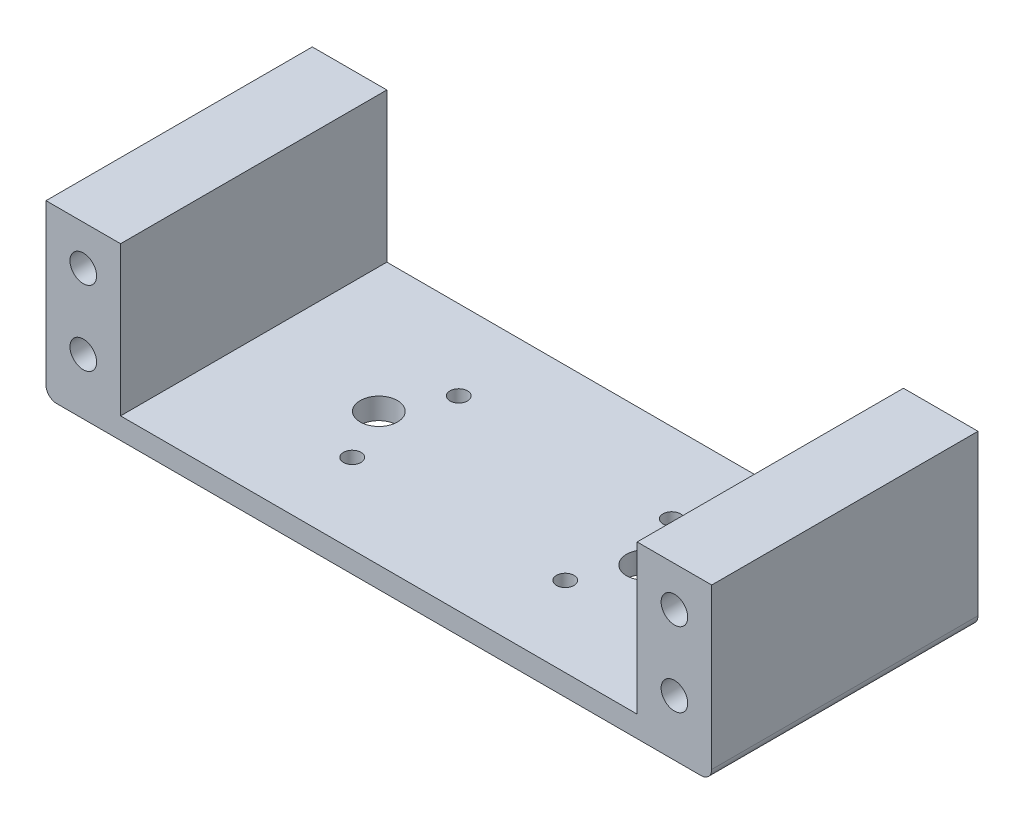
ISO-10303-21;
HEADER;
FILE_DESCRIPTION(('STEP AP214'),'2;1');
FILE_NAME('part.step','',(''),(''),'','','');
FILE_SCHEMA(('AUTOMOTIVE_DESIGN { 1 0 10303 214 1 1 1 1 }'));
ENDSEC;
DATA;
#1=APPLICATION_CONTEXT('core data for automotive mechanical design processes');
#2=APPLICATION_PROTOCOL_DEFINITION('international standard','automotive_design',2000,#1);
#3=PRODUCT_CONTEXT('',#1,'mechanical');
#4=PRODUCT('Part','Part','',(#3));
#5=PRODUCT_RELATED_PRODUCT_CATEGORY('part','',(#4));
#6=PRODUCT_DEFINITION_FORMATION('','',#4);
#7=PRODUCT_DEFINITION_CONTEXT('part definition',#1,'design');
#8=PRODUCT_DEFINITION('design','',#6,#7);
#9=PRODUCT_DEFINITION_SHAPE('','',#8);
#10=(LENGTH_UNIT() NAMED_UNIT(*) SI_UNIT(.MILLI.,.METRE.));
#11=(NAMED_UNIT(*) PLANE_ANGLE_UNIT() SI_UNIT($,.RADIAN.));
#12=(NAMED_UNIT(*) SI_UNIT($,.STERADIAN.) SOLID_ANGLE_UNIT());
#13=UNCERTAINTY_MEASURE_WITH_UNIT(LENGTH_MEASURE(1.E-05),#10,'distance_accuracy_value','');
#14=(GEOMETRIC_REPRESENTATION_CONTEXT(3) GLOBAL_UNCERTAINTY_ASSIGNED_CONTEXT((#13)) GLOBAL_UNIT_ASSIGNED_CONTEXT((#10,
#11,#12)) REPRESENTATION_CONTEXT('',''));
#15=CARTESIAN_POINT('',(0.,0.,0.));
#16=DIRECTION('',(0.,0.,1.));
#17=DIRECTION('',(1.,0.,0.));
#18=AXIS2_PLACEMENT_3D('',#15,#16,#17);
#19=CARTESIAN_POINT('',(0.,4.,0.));
#20=DIRECTION('',(0.,-1.,0.));
#21=DIRECTION('',(0.,0.,-1.));
#22=AXIS2_PLACEMENT_3D('',#19,#20,#21);
#23=PLANE('',#22);
#24=CARTESIAN_POINT('',(37.5,4.,-25.));
#25=DIRECTION('',(0.,-1.,0.));
#26=DIRECTION('',(0.,0.,-1.));
#27=AXIS2_PLACEMENT_3D('',#24,#25,#26);
#28=CIRCLE('',#27,3.5);
#29=CARTESIAN_POINT('',(37.5,4.,-28.5));
#30=VERTEX_POINT('',#29);
#31=EDGE_CURVE('E385',#30,#30,#28,.T.);
#32=ORIENTED_EDGE('',*,*,#31,.T.);
#33=EDGE_LOOP('',(#32));
#34=FACE_BOUND('',#33,.T.);
#35=CARTESIAN_POINT('',(42.5,4.,-35.));
#36=DIRECTION('',(0.,-1.,0.));
#37=DIRECTION('',(0.,0.,-1.));
#38=AXIS2_PLACEMENT_3D('',#35,#36,#37);
#39=CIRCLE('',#38,1.65);
#40=CARTESIAN_POINT('',(42.5,4.,-36.65));
#41=VERTEX_POINT('',#40);
#42=EDGE_CURVE('E400',#41,#41,#39,.T.);
#43=ORIENTED_EDGE('',*,*,#42,.T.);
#44=EDGE_LOOP('',(#43));
#45=FACE_BOUND('',#44,.T.);
#46=CARTESIAN_POINT('',(82.5,4.,-35.));
#47=DIRECTION('',(0.,-1.,0.));
#48=DIRECTION('',(0.,0.,-1.));
#49=AXIS2_PLACEMENT_3D('',#46,#47,#48);
#50=CIRCLE('',#49,1.65);
#51=CARTESIAN_POINT('',(82.5,4.,-36.65));
#52=VERTEX_POINT('',#51);
#53=EDGE_CURVE('E403',#52,#52,#50,.T.);
#54=ORIENTED_EDGE('',*,*,#53,.T.);
#55=EDGE_LOOP('',(#54));
#56=FACE_BOUND('',#55,.T.);
#57=CARTESIAN_POINT('',(42.5,4.,-15.));
#58=DIRECTION('',(0.,-1.,0.));
#59=DIRECTION('',(0.,0.,-1.));
#60=AXIS2_PLACEMENT_3D('',#57,#58,#59);
#61=CIRCLE('',#60,1.65);
#62=CARTESIAN_POINT('',(42.5,4.,-16.65));
#63=VERTEX_POINT('',#62);
#64=EDGE_CURVE('E406',#63,#63,#61,.T.);
#65=ORIENTED_EDGE('',*,*,#64,.T.);
#66=EDGE_LOOP('',(#65));
#67=FACE_BOUND('',#66,.T.);
#68=CARTESIAN_POINT('',(87.5,4.,-25.));
#69=DIRECTION('',(0.,-1.,0.));
#70=DIRECTION('',(0.,0.,-1.));
#71=AXIS2_PLACEMENT_3D('',#68,#69,#70);
#72=CIRCLE('',#71,3.49999999999999);
#73=CARTESIAN_POINT('',(87.5,4.,-28.5));
#74=VERTEX_POINT('',#73);
#75=EDGE_CURVE('E409',#74,#74,#72,.T.);
#76=ORIENTED_EDGE('',*,*,#75,.T.);
#77=EDGE_LOOP('',(#76));
#78=FACE_BOUND('',#77,.T.);
#79=CARTESIAN_POINT('',(82.5,4.,-15.));
#80=DIRECTION('',(0.,-1.,0.));
#81=DIRECTION('',(0.,0.,-1.));
#82=AXIS2_PLACEMENT_3D('',#79,#80,#81);
#83=CIRCLE('',#82,1.65);
#84=CARTESIAN_POINT('',(82.5,4.,-16.65));
#85=VERTEX_POINT('',#84);
#86=EDGE_CURVE('E412',#85,#85,#83,.T.);
#87=ORIENTED_EDGE('',*,*,#86,.T.);
#88=EDGE_LOOP('',(#87));
#89=FACE_BOUND('',#88,.T.);
#90=DIRECTION('',(0.,0.,1.));
#91=VECTOR('',#90,1.);
#92=CARTESIAN_POINT('',(111.,4.,0.));
#93=LINE('',#92,#91);
#94=CARTESIAN_POINT('',(111.,4.,-50.));
#95=VERTEX_POINT('',#94);
#96=CARTESIAN_POINT('',(111.,4.,0.));
#97=VERTEX_POINT('',#96);
#98=EDGE_CURVE('E138',#95,#97,#93,.T.);
#99=ORIENTED_EDGE('',*,*,#98,.F.);
#100=DIRECTION('',(-1.,0.,0.));
#101=VECTOR('',#100,1.);
#102=CARTESIAN_POINT('',(0.,4.,-50.));
#103=LINE('',#102,#101);
#104=CARTESIAN_POINT('',(14.,4.,-50.));
#105=VERTEX_POINT('',#104);
#106=EDGE_CURVE('E175',#95,#105,#103,.T.);
#107=ORIENTED_EDGE('',*,*,#106,.T.);
#108=DIRECTION('',(0.,0.,-1.));
#109=VECTOR('',#108,1.);
#110=CARTESIAN_POINT('',(14.,4.,-50.));
#111=LINE('',#110,#109);
#112=CARTESIAN_POINT('',(14.,4.,0.));
#113=VERTEX_POINT('',#112);
#114=EDGE_CURVE('E153',#113,#105,#111,.T.);
#115=ORIENTED_EDGE('',*,*,#114,.F.);
#116=DIRECTION('',(1.,0.,0.));
#117=VECTOR('',#116,1.);
#118=CARTESIAN_POINT('',(0.,4.,0.));
#119=LINE('',#118,#117);
#120=EDGE_CURVE('E173',#113,#97,#119,.T.);
#121=ORIENTED_EDGE('',*,*,#120,.T.);
#122=EDGE_LOOP('',(#99,#107,#115,#121));
#123=FACE_BOUND('',#122,.T.);
#124=ADVANCED_FACE('F33',(#34,#45,#56,#67,#78,#89,#123),#23,.F.);
#125=CARTESIAN_POINT('',(0.,4.,0.));
#126=DIRECTION('',(1.,0.,0.));
#127=DIRECTION('',(0.,0.,-1.));
#128=AXIS2_PLACEMENT_3D('',#125,#126,#127);
#129=PLANE('',#128);
#130=DIRECTION('',(0.,-1.,0.));
#131=VECTOR('',#130,1.);
#132=CARTESIAN_POINT('',(0.,4.,-50.));
#133=LINE('',#132,#131);
#134=CARTESIAN_POINT('',(0.,32.,-50.));
#135=VERTEX_POINT('',#134);
#136=CARTESIAN_POINT('',(0.,2.,-50.));
#137=VERTEX_POINT('',#136);
#138=EDGE_CURVE('E123',#135,#137,#133,.T.);
#139=ORIENTED_EDGE('',*,*,#138,.T.);
#140=DIRECTION('',(0.,0.,1.));
#141=VECTOR('',#140,1.);
#142=CARTESIAN_POINT('',(0.,2.,0.));
#143=LINE('',#142,#141);
#144=CARTESIAN_POINT('',(0.,2.,0.));
#145=VERTEX_POINT('',#144);
#146=EDGE_CURVE('E11',#137,#145,#143,.T.);
#147=ORIENTED_EDGE('',*,*,#146,.T.);
#148=DIRECTION('',(0.,-1.,0.));
#149=VECTOR('',#148,1.);
#150=CARTESIAN_POINT('',(0.,4.,0.));
#151=LINE('',#150,#149);
#152=CARTESIAN_POINT('',(0.,32.,0.));
#153=VERTEX_POINT('',#152);
#154=EDGE_CURVE('E184',#153,#145,#151,.T.);
#155=ORIENTED_EDGE('',*,*,#154,.F.);
#156=DIRECTION('',(0.,0.,1.));
#157=VECTOR('',#156,1.);
#158=CARTESIAN_POINT('',(0.,32.,-50.));
#159=LINE('',#158,#157);
#160=EDGE_CURVE('E154',#135,#153,#159,.T.);
#161=ORIENTED_EDGE('',*,*,#160,.F.);
#162=EDGE_LOOP('',(#139,#147,#155,#161));
#163=FACE_BOUND('',#162,.T.);
#164=ADVANCED_FACE('F205',(#163),#129,.F.);
#165=CARTESIAN_POINT('',(0.,4.,0.));
#166=DIRECTION('',(0.,0.,-1.));
#167=DIRECTION('',(-1.,0.,0.));
#168=AXIS2_PLACEMENT_3D('',#165,#166,#167);
#169=PLANE('',#168);
#170=CARTESIAN_POINT('',(118.,24.5,0.));
#171=DIRECTION('',(0.,0.,1.));
#172=DIRECTION('',(-1.,0.,0.));
#173=AXIS2_PLACEMENT_3D('',#170,#171,#172);
#174=CIRCLE('',#173,2.49999999999999);
#175=CARTESIAN_POINT('',(115.5,24.5,0.));
#176=VERTEX_POINT('',#175);
#177=EDGE_CURVE('E371',#176,#176,#174,.T.);
#178=ORIENTED_EDGE('',*,*,#177,.F.);
#179=EDGE_LOOP('',(#178));
#180=FACE_BOUND('',#179,.T.);
#181=CARTESIAN_POINT('',(118.,10.5,0.));
#182=DIRECTION('',(0.,0.,1.));
#183=DIRECTION('',(-1.,0.,0.));
#184=AXIS2_PLACEMENT_3D('',#181,#182,#183);
#185=CIRCLE('',#184,2.5);
#186=CARTESIAN_POINT('',(115.5,10.5,0.));
#187=VERTEX_POINT('',#186);
#188=EDGE_CURVE('E365',#187,#187,#185,.T.);
#189=ORIENTED_EDGE('',*,*,#188,.F.);
#190=EDGE_LOOP('',(#189));
#191=FACE_BOUND('',#190,.T.);
#192=CARTESIAN_POINT('',(7.00000000000001,10.5,0.));
#193=DIRECTION('',(0.,0.,1.));
#194=DIRECTION('',(1.,0.,0.));
#195=AXIS2_PLACEMENT_3D('',#192,#193,#194);
#196=CIRCLE('',#195,2.5);
#197=CARTESIAN_POINT('',(9.50000000000001,10.5,0.));
#198=VERTEX_POINT('',#197);
#199=EDGE_CURVE('E353',#198,#198,#196,.T.);
#200=ORIENTED_EDGE('',*,*,#199,.F.);
#201=EDGE_LOOP('',(#200));
#202=FACE_BOUND('',#201,.T.);
#203=CARTESIAN_POINT('',(7.00000000000001,24.5,0.));
#204=DIRECTION('',(0.,0.,1.));
#205=DIRECTION('',(1.,0.,0.));
#206=AXIS2_PLACEMENT_3D('',#203,#204,#205);
#207=CIRCLE('',#206,2.5);
#208=CARTESIAN_POINT('',(9.50000000000001,24.5,0.));
#209=VERTEX_POINT('',#208);
#210=EDGE_CURVE('E144',#209,#209,#207,.T.);
#211=ORIENTED_EDGE('',*,*,#210,.F.);
#212=EDGE_LOOP('',(#211));
#213=FACE_BOUND('',#212,.T.);
#214=DIRECTION('',(1.,0.,0.));
#215=VECTOR('',#214,1.);
#216=CARTESIAN_POINT('',(0.,0.,0.));
#217=LINE('',#216,#215);
#218=CARTESIAN_POINT('',(2.,0.,0.));
#219=VERTEX_POINT('',#218);
#220=CARTESIAN_POINT('',(123.,0.,0.));
#221=VERTEX_POINT('',#220);
#222=EDGE_CURVE('E172',#219,#221,#217,.T.);
#223=ORIENTED_EDGE('',*,*,#222,.T.);
#224=CARTESIAN_POINT('',(123.,2.,0.));
#225=DIRECTION('',(0.,0.,-1.));
#226=DIRECTION('',(-1.,0.,0.));
#227=AXIS2_PLACEMENT_3D('',#224,#225,#226);
#228=CIRCLE('',#227,2.);
#229=CARTESIAN_POINT('',(125.,2.,0.));
#230=VERTEX_POINT('',#229);
#231=EDGE_CURVE('E41',#221,#230,#228,.F.);
#232=ORIENTED_EDGE('',*,*,#231,.T.);
#233=DIRECTION('',(0.,-1.,0.));
#234=VECTOR('',#233,1.);
#235=CARTESIAN_POINT('',(125.,4.,0.));
#236=LINE('',#235,#234);
#237=CARTESIAN_POINT('',(125.,32.,0.));
#238=VERTEX_POINT('',#237);
#239=EDGE_CURVE('E122',#238,#230,#236,.T.);
#240=ORIENTED_EDGE('',*,*,#239,.F.);
#241=DIRECTION('',(1.,0.,0.));
#242=VECTOR('',#241,1.);
#243=CARTESIAN_POINT('',(125.,32.,0.));
#244=LINE('',#243,#242);
#245=CARTESIAN_POINT('',(111.,32.,0.));
#246=VERTEX_POINT('',#245);
#247=EDGE_CURVE('E137',#246,#238,#244,.T.);
#248=ORIENTED_EDGE('',*,*,#247,.F.);
#249=DIRECTION('',(0.,-1.,0.));
#250=VECTOR('',#249,1.);
#251=CARTESIAN_POINT('',(111.,32.,0.));
#252=LINE('',#251,#250);
#253=EDGE_CURVE('E148',#246,#97,#252,.T.);
#254=ORIENTED_EDGE('',*,*,#253,.T.);
#255=ORIENTED_EDGE('',*,*,#120,.F.);
#256=DIRECTION('',(0.,-1.,0.));
#257=VECTOR('',#256,1.);
#258=CARTESIAN_POINT('',(14.,32.,0.));
#259=LINE('',#258,#257);
#260=CARTESIAN_POINT('',(14.,32.,0.));
#261=VERTEX_POINT('',#260);
#262=EDGE_CURVE('E169',#261,#113,#259,.T.);
#263=ORIENTED_EDGE('',*,*,#262,.F.);
#264=DIRECTION('',(1.,0.,0.));
#265=VECTOR('',#264,1.);
#266=CARTESIAN_POINT('',(0.,32.,0.));
#267=LINE('',#266,#265);
#268=EDGE_CURVE('E157',#153,#261,#267,.T.);
#269=ORIENTED_EDGE('',*,*,#268,.F.);
#270=ORIENTED_EDGE('',*,*,#154,.T.);
#271=CARTESIAN_POINT('',(2.,2.,0.));
#272=DIRECTION('',(0.,0.,-1.));
#273=DIRECTION('',(-1.,0.,0.));
#274=AXIS2_PLACEMENT_3D('',#271,#272,#273);
#275=CIRCLE('',#274,2.);
#276=EDGE_CURVE('E48',#145,#219,#275,.F.);
#277=ORIENTED_EDGE('',*,*,#276,.T.);
#278=EDGE_LOOP('',(#223,#232,#240,#248,#254,#255,#263,#269,#270,#277));
#279=FACE_BOUND('',#278,.T.);
#280=ADVANCED_FACE('F197',(#180,#191,#202,#213,#279),#169,.F.);
#281=CARTESIAN_POINT('',(125.,4.,0.));
#282=DIRECTION('',(-1.,0.,0.));
#283=DIRECTION('',(0.,0.,1.));
#284=AXIS2_PLACEMENT_3D('',#281,#282,#283);
#285=PLANE('',#284);
#286=ORIENTED_EDGE('',*,*,#239,.T.);
#287=DIRECTION('',(0.,0.,-1.));
#288=VECTOR('',#287,1.);
#289=CARTESIAN_POINT('',(125.,2.,-50.));
#290=LINE('',#289,#288);
#291=CARTESIAN_POINT('',(125.,2.,-50.));
#292=VERTEX_POINT('',#291);
#293=EDGE_CURVE('E120',#230,#292,#290,.T.);
#294=ORIENTED_EDGE('',*,*,#293,.T.);
#295=DIRECTION('',(0.,-1.,0.));
#296=VECTOR('',#295,1.);
#297=CARTESIAN_POINT('',(125.,4.,-50.));
#298=LINE('',#297,#296);
#299=CARTESIAN_POINT('',(125.,32.,-50.));
#300=VERTEX_POINT('',#299);
#301=EDGE_CURVE('E113',#300,#292,#298,.T.);
#302=ORIENTED_EDGE('',*,*,#301,.F.);
#303=DIRECTION('',(0.,0.,-1.));
#304=VECTOR('',#303,1.);
#305=CARTESIAN_POINT('',(125.,32.,0.));
#306=LINE('',#305,#304);
#307=EDGE_CURVE('E118',#238,#300,#306,.T.);
#308=ORIENTED_EDGE('',*,*,#307,.F.);
#309=EDGE_LOOP('',(#286,#294,#302,#308));
#310=FACE_BOUND('',#309,.T.);
#311=ADVANCED_FACE('F116',(#310),#285,.F.);
#312=CARTESIAN_POINT('',(0.,4.,-50.));
#313=DIRECTION('',(0.,0.,1.));
#314=DIRECTION('',(1.,0.,0.));
#315=AXIS2_PLACEMENT_3D('',#312,#313,#314);
#316=PLANE('',#315);
#317=CARTESIAN_POINT('',(118.,24.5,-50.));
#318=DIRECTION('',(0.,0.,1.));
#319=DIRECTION('',(-1.,0.,0.));
#320=AXIS2_PLACEMENT_3D('',#317,#318,#319);
#321=CIRCLE('',#320,2.49999999999999);
#322=CARTESIAN_POINT('',(115.5,24.5,-50.));
#323=VERTEX_POINT('',#322);
#324=EDGE_CURVE('E381',#323,#323,#321,.T.);
#325=ORIENTED_EDGE('',*,*,#324,.T.);
#326=EDGE_LOOP('',(#325));
#327=FACE_BOUND('',#326,.T.);
#328=CARTESIAN_POINT('',(118.,10.5,-50.));
#329=DIRECTION('',(0.,0.,1.));
#330=DIRECTION('',(-1.,0.,0.));
#331=AXIS2_PLACEMENT_3D('',#328,#329,#330);
#332=CIRCLE('',#331,2.5);
#333=CARTESIAN_POINT('',(115.5,10.5,-50.));
#334=VERTEX_POINT('',#333);
#335=EDGE_CURVE('E388',#334,#334,#332,.T.);
#336=ORIENTED_EDGE('',*,*,#335,.T.);
#337=EDGE_LOOP('',(#336));
#338=FACE_BOUND('',#337,.T.);
#339=CARTESIAN_POINT('',(7.00000000000001,10.5,-50.));
#340=DIRECTION('',(0.,0.,1.));
#341=DIRECTION('',(1.,0.,0.));
#342=AXIS2_PLACEMENT_3D('',#339,#340,#341);
#343=CIRCLE('',#342,2.5);
#344=CARTESIAN_POINT('',(9.50000000000001,10.5,-50.));
#345=VERTEX_POINT('',#344);
#346=EDGE_CURVE('E394',#345,#345,#343,.T.);
#347=ORIENTED_EDGE('',*,*,#346,.T.);
#348=EDGE_LOOP('',(#347));
#349=FACE_BOUND('',#348,.T.);
#350=CARTESIAN_POINT('',(7.00000000000001,24.5,-50.));
#351=DIRECTION('',(0.,0.,1.));
#352=DIRECTION('',(1.,0.,0.));
#353=AXIS2_PLACEMENT_3D('',#350,#351,#352);
#354=CIRCLE('',#353,2.5);
#355=CARTESIAN_POINT('',(9.50000000000001,24.5,-50.));
#356=VERTEX_POINT('',#355);
#357=EDGE_CURVE('E360',#356,#356,#354,.T.);
#358=ORIENTED_EDGE('',*,*,#357,.T.);
#359=EDGE_LOOP('',(#358));
#360=FACE_BOUND('',#359,.T.);
#361=ORIENTED_EDGE('',*,*,#301,.T.);
#362=CARTESIAN_POINT('',(123.,2.,-50.));
#363=DIRECTION('',(0.,0.,1.));
#364=DIRECTION('',(1.,0.,0.));
#365=AXIS2_PLACEMENT_3D('',#362,#363,#364);
#366=CIRCLE('',#365,2.);
#367=CARTESIAN_POINT('',(123.,0.,-50.));
#368=VERTEX_POINT('',#367);
#369=EDGE_CURVE('E190',#292,#368,#366,.F.);
#370=ORIENTED_EDGE('',*,*,#369,.T.);
#371=DIRECTION('',(-1.,0.,0.));
#372=VECTOR('',#371,1.);
#373=CARTESIAN_POINT('',(0.,0.,-50.));
#374=LINE('',#373,#372);
#375=CARTESIAN_POINT('',(2.,0.,-50.));
#376=VERTEX_POINT('',#375);
#377=EDGE_CURVE('E176',#368,#376,#374,.T.);
#378=ORIENTED_EDGE('',*,*,#377,.T.);
#379=CARTESIAN_POINT('',(2.,2.,-50.));
#380=DIRECTION('',(0.,0.,1.));
#381=DIRECTION('',(1.,0.,0.));
#382=AXIS2_PLACEMENT_3D('',#379,#380,#381);
#383=CIRCLE('',#382,2.);
#384=EDGE_CURVE('E188',#376,#137,#383,.F.);
#385=ORIENTED_EDGE('',*,*,#384,.T.);
#386=ORIENTED_EDGE('',*,*,#138,.F.);
#387=DIRECTION('',(-1.,0.,0.));
#388=VECTOR('',#387,1.);
#389=CARTESIAN_POINT('',(0.,32.,-50.));
#390=LINE('',#389,#388);
#391=CARTESIAN_POINT('',(14.,32.,-50.));
#392=VERTEX_POINT('',#391);
#393=EDGE_CURVE('E161',#392,#135,#390,.T.);
#394=ORIENTED_EDGE('',*,*,#393,.F.);
#395=DIRECTION('',(0.,-1.,0.));
#396=VECTOR('',#395,1.);
#397=CARTESIAN_POINT('',(14.,32.,-50.));
#398=LINE('',#397,#396);
#399=EDGE_CURVE('E164',#392,#105,#398,.T.);
#400=ORIENTED_EDGE('',*,*,#399,.T.);
#401=ORIENTED_EDGE('',*,*,#106,.F.);
#402=DIRECTION('',(0.,-1.,0.));
#403=VECTOR('',#402,1.);
#404=CARTESIAN_POINT('',(111.,32.,-50.));
#405=LINE('',#404,#403);
#406=CARTESIAN_POINT('',(111.,32.,-50.));
#407=VERTEX_POINT('',#406);
#408=EDGE_CURVE('E129',#407,#95,#405,.T.);
#409=ORIENTED_EDGE('',*,*,#408,.F.);
#410=DIRECTION('',(-1.,0.,0.));
#411=VECTOR('',#410,1.);
#412=CARTESIAN_POINT('',(125.,32.,-50.));
#413=LINE('',#412,#411);
#414=EDGE_CURVE('E126',#300,#407,#413,.T.);
#415=ORIENTED_EDGE('',*,*,#414,.F.);
#416=EDGE_LOOP('',(#361,#370,#378,#385,#386,#394,#400,#401,#409,#415));
#417=FACE_BOUND('',#416,.T.);
#418=ADVANCED_FACE('F127',(#327,#338,#349,#360,#417),#316,.F.);
#419=CARTESIAN_POINT('',(0.,0.,0.));
#420=DIRECTION('',(0.,-1.,0.));
#421=DIRECTION('',(0.,0.,-1.));
#422=AXIS2_PLACEMENT_3D('',#419,#420,#421);
#423=PLANE('',#422);
#424=CARTESIAN_POINT('',(37.5,0.,-25.));
#425=DIRECTION('',(0.,-1.,0.));
#426=DIRECTION('',(0.,0.,-1.));
#427=AXIS2_PLACEMENT_3D('',#424,#425,#426);
#428=CIRCLE('',#427,3.5);
#429=CARTESIAN_POINT('',(37.5,0.,-28.5));
#430=VERTEX_POINT('',#429);
#431=EDGE_CURVE('E425',#430,#430,#428,.T.);
#432=ORIENTED_EDGE('',*,*,#431,.F.);
#433=EDGE_LOOP('',(#432));
#434=FACE_BOUND('',#433,.T.);
#435=CARTESIAN_POINT('',(42.5,0.,-35.));
#436=DIRECTION('',(0.,-1.,0.));
#437=DIRECTION('',(0.,0.,-1.));
#438=AXIS2_PLACEMENT_3D('',#435,#436,#437);
#439=CIRCLE('',#438,1.65);
#440=CARTESIAN_POINT('',(42.5,0.,-36.65));
#441=VERTEX_POINT('',#440);
#442=EDGE_CURVE('E422',#441,#441,#439,.T.);
#443=ORIENTED_EDGE('',*,*,#442,.F.);
#444=EDGE_LOOP('',(#443));
#445=FACE_BOUND('',#444,.T.);
#446=CARTESIAN_POINT('',(82.5,0.,-35.));
#447=DIRECTION('',(0.,-1.,0.));
#448=DIRECTION('',(0.,0.,1.));
#449=AXIS2_PLACEMENT_3D('',#446,#447,#448);
#450=CIRCLE('',#449,1.65);
#451=CARTESIAN_POINT('',(82.5,0.,-33.35));
#452=VERTEX_POINT('',#451);
#453=EDGE_CURVE('E419',#452,#452,#450,.T.);
#454=ORIENTED_EDGE('',*,*,#453,.F.);
#455=EDGE_LOOP('',(#454));
#456=FACE_BOUND('',#455,.T.);
#457=CARTESIAN_POINT('',(42.5,0.,-15.));
#458=DIRECTION('',(0.,-1.,0.));
#459=DIRECTION('',(0.,0.,1.));
#460=AXIS2_PLACEMENT_3D('',#457,#458,#459);
#461=CIRCLE('',#460,1.65);
#462=CARTESIAN_POINT('',(42.5,0.,-13.35));
#463=VERTEX_POINT('',#462);
#464=EDGE_CURVE('E418',#463,#463,#461,.T.);
#465=ORIENTED_EDGE('',*,*,#464,.F.);
#466=EDGE_LOOP('',(#465));
#467=FACE_BOUND('',#466,.T.);
#468=CARTESIAN_POINT('',(87.5,0.,-25.));
#469=DIRECTION('',(0.,-1.,0.));
#470=DIRECTION('',(0.,0.,1.));
#471=AXIS2_PLACEMENT_3D('',#468,#469,#470);
#472=CIRCLE('',#471,3.49999999999999);
#473=CARTESIAN_POINT('',(87.5,0.,-21.5));
#474=VERTEX_POINT('',#473);
#475=EDGE_CURVE('E427',#474,#474,#472,.T.);
#476=ORIENTED_EDGE('',*,*,#475,.F.);
#477=EDGE_LOOP('',(#476));
#478=FACE_BOUND('',#477,.T.);
#479=CARTESIAN_POINT('',(82.5,0.,-15.));
#480=DIRECTION('',(0.,-1.,0.));
#481=DIRECTION('',(0.,0.,-1.));
#482=AXIS2_PLACEMENT_3D('',#479,#480,#481);
#483=CIRCLE('',#482,1.65);
#484=CARTESIAN_POINT('',(82.5,0.,-16.65));
#485=VERTEX_POINT('',#484);
#486=EDGE_CURVE('E415',#485,#485,#483,.T.);
#487=ORIENTED_EDGE('',*,*,#486,.F.);
#488=EDGE_LOOP('',(#487));
#489=FACE_BOUND('',#488,.T.);
#490=ORIENTED_EDGE('',*,*,#377,.F.);
#491=DIRECTION('',(0.,0.,-1.));
#492=VECTOR('',#491,1.);
#493=CARTESIAN_POINT('',(123.,0.,0.));
#494=LINE('',#493,#492);
#495=EDGE_CURVE('E55',#368,#221,#494,.F.);
#496=ORIENTED_EDGE('',*,*,#495,.T.);
#497=ORIENTED_EDGE('',*,*,#222,.F.);
#498=DIRECTION('',(0.,0.,1.));
#499=VECTOR('',#498,1.);
#500=CARTESIAN_POINT('',(2.,0.,-50.));
#501=LINE('',#500,#499);
#502=EDGE_CURVE('E192',#219,#376,#501,.F.);
#503=ORIENTED_EDGE('',*,*,#502,.T.);
#504=EDGE_LOOP('',(#490,#496,#497,#503));
#505=FACE_BOUND('',#504,.T.);
#506=ADVANCED_FACE('F201',(#434,#445,#456,#467,#478,#489,#505),#423,.T.);
#507=CARTESIAN_POINT('',(14.,32.,-50.));
#508=DIRECTION('',(-1.,0.,0.));
#509=DIRECTION('',(0.,0.,1.));
#510=AXIS2_PLACEMENT_3D('',#507,#508,#509);
#511=PLANE('',#510);
#512=ORIENTED_EDGE('',*,*,#114,.T.);
#513=ORIENTED_EDGE('',*,*,#399,.F.);
#514=DIRECTION('',(0.,0.,-1.));
#515=VECTOR('',#514,1.);
#516=CARTESIAN_POINT('',(14.,32.,-50.));
#517=LINE('',#516,#515);
#518=EDGE_CURVE('E159',#261,#392,#517,.T.);
#519=ORIENTED_EDGE('',*,*,#518,.F.);
#520=ORIENTED_EDGE('',*,*,#262,.T.);
#521=EDGE_LOOP('',(#512,#513,#519,#520));
#522=FACE_BOUND('',#521,.T.);
#523=ADVANCED_FACE('F214',(#522),#511,.F.);
#524=CARTESIAN_POINT('',(0.,32.,0.));
#525=DIRECTION('',(0.,1.,0.));
#526=DIRECTION('',(0.,0.,1.));
#527=AXIS2_PLACEMENT_3D('',#524,#525,#526);
#528=PLANE('',#527);
#529=ORIENTED_EDGE('',*,*,#160,.T.);
#530=ORIENTED_EDGE('',*,*,#268,.T.);
#531=ORIENTED_EDGE('',*,*,#518,.T.);
#532=ORIENTED_EDGE('',*,*,#393,.T.);
#533=EDGE_LOOP('',(#529,#530,#531,#532));
#534=FACE_BOUND('',#533,.T.);
#535=ADVANCED_FACE('F208',(#534),#528,.T.);
#536=CARTESIAN_POINT('',(111.,32.,0.));
#537=DIRECTION('',(1.,0.,0.));
#538=DIRECTION('',(0.,0.,-1.));
#539=AXIS2_PLACEMENT_3D('',#536,#537,#538);
#540=PLANE('',#539);
#541=ORIENTED_EDGE('',*,*,#98,.T.);
#542=ORIENTED_EDGE('',*,*,#253,.F.);
#543=DIRECTION('',(0.,0.,1.));
#544=VECTOR('',#543,1.);
#545=CARTESIAN_POINT('',(111.,32.,0.));
#546=LINE('',#545,#544);
#547=EDGE_CURVE('E132',#407,#246,#546,.T.);
#548=ORIENTED_EDGE('',*,*,#547,.F.);
#549=ORIENTED_EDGE('',*,*,#408,.T.);
#550=EDGE_LOOP('',(#541,#542,#548,#549));
#551=FACE_BOUND('',#550,.T.);
#552=ADVANCED_FACE('F219',(#551),#540,.F.);
#553=CARTESIAN_POINT('',(0.,32.,0.));
#554=DIRECTION('',(0.,1.,0.));
#555=DIRECTION('',(0.,0.,1.));
#556=AXIS2_PLACEMENT_3D('',#553,#554,#555);
#557=PLANE('',#556);
#558=ORIENTED_EDGE('',*,*,#307,.T.);
#559=ORIENTED_EDGE('',*,*,#414,.T.);
#560=ORIENTED_EDGE('',*,*,#547,.T.);
#561=ORIENTED_EDGE('',*,*,#247,.T.);
#562=EDGE_LOOP('',(#558,#559,#560,#561));
#563=FACE_BOUND('',#562,.T.);
#564=ADVANCED_FACE('F135',(#563),#557,.T.);
#565=CARTESIAN_POINT('',(7.00000000000001,24.5,-4.78));
#566=DIRECTION('',(0.,0.,1.));
#567=DIRECTION('',(1.,0.,0.));
#568=AXIS2_PLACEMENT_3D('',#565,#566,#567);
#569=CYLINDRICAL_SURFACE('',#568,2.5);
#570=CARTESIAN_POINT('',(7.00000000000001,24.5,-4.78));
#571=DIRECTION('',(0.,0.,1.));
#572=DIRECTION('',(1.,0.,0.));
#573=AXIS2_PLACEMENT_3D('',#570,#571,#572);
#574=CIRCLE('',#573,2.5);
#575=CARTESIAN_POINT('',(9.50000000000001,24.5,-4.78));
#576=VERTEX_POINT('',#575);
#577=EDGE_CURVE('E141',#576,#576,#574,.T.);
#578=ORIENTED_EDGE('',*,*,#577,.F.);
#579=EDGE_LOOP('',(#578));
#580=FACE_BOUND('',#579,.T.);
#581=ORIENTED_EDGE('',*,*,#210,.T.);
#582=EDGE_LOOP('',(#581));
#583=FACE_BOUND('',#582,.T.);
#584=ADVANCED_FACE('F226',(#580,#583),#569,.F.);
#585=CARTESIAN_POINT('',(7.00000000000001,24.5,-4.78));
#586=DIRECTION('',(0.,0.,1.));
#587=DIRECTION('',(1.,0.,0.));
#588=AXIS2_PLACEMENT_3D('',#585,#586,#587);
#589=PLANE('',#588);
#590=ORIENTED_EDGE('',*,*,#577,.T.);
#591=EDGE_LOOP('',(#590));
#592=FACE_BOUND('',#591,.T.);
#593=ADVANCED_FACE('F322',(#592),#589,.T.);
#594=CARTESIAN_POINT('',(7.00000000000001,10.5,-4.78));
#595=DIRECTION('',(0.,0.,1.));
#596=DIRECTION('',(1.,0.,0.));
#597=AXIS2_PLACEMENT_3D('',#594,#595,#596);
#598=CYLINDRICAL_SURFACE('',#597,2.5);
#599=CARTESIAN_POINT('',(7.00000000000001,10.5,-4.78));
#600=DIRECTION('',(0.,0.,1.));
#601=DIRECTION('',(1.,0.,0.));
#602=AXIS2_PLACEMENT_3D('',#599,#600,#601);
#603=CIRCLE('',#602,2.5);
#604=CARTESIAN_POINT('',(9.50000000000001,10.5,-4.78));
#605=VERTEX_POINT('',#604);
#606=EDGE_CURVE('E351',#605,#605,#603,.T.);
#607=ORIENTED_EDGE('',*,*,#606,.F.);
#608=EDGE_LOOP('',(#607));
#609=FACE_BOUND('',#608,.T.);
#610=ORIENTED_EDGE('',*,*,#199,.T.);
#611=EDGE_LOOP('',(#610));
#612=FACE_BOUND('',#611,.T.);
#613=ADVANCED_FACE('F318',(#609,#612),#598,.F.);
#614=CARTESIAN_POINT('',(7.00000000000001,10.5,-4.78));
#615=DIRECTION('',(0.,0.,1.));
#616=DIRECTION('',(1.,0.,0.));
#617=AXIS2_PLACEMENT_3D('',#614,#615,#616);
#618=PLANE('',#617);
#619=ORIENTED_EDGE('',*,*,#606,.T.);
#620=EDGE_LOOP('',(#619));
#621=FACE_BOUND('',#620,.T.);
#622=ADVANCED_FACE('F314',(#621),#618,.T.);
#623=CARTESIAN_POINT('',(118.,10.5,-4.78));
#624=DIRECTION('',(0.,0.,1.));
#625=DIRECTION('',(1.,0.,0.));
#626=AXIS2_PLACEMENT_3D('',#623,#624,#625);
#627=CYLINDRICAL_SURFACE('',#626,2.5);
#628=CARTESIAN_POINT('',(118.,10.5,-4.78));
#629=DIRECTION('',(0.,0.,1.));
#630=DIRECTION('',(-1.,0.,0.));
#631=AXIS2_PLACEMENT_3D('',#628,#629,#630);
#632=CIRCLE('',#631,2.5);
#633=CARTESIAN_POINT('',(115.5,10.5,-4.78));
#634=VERTEX_POINT('',#633);
#635=EDGE_CURVE('E357',#634,#634,#632,.T.);
#636=ORIENTED_EDGE('',*,*,#635,.F.);
#637=EDGE_LOOP('',(#636));
#638=FACE_BOUND('',#637,.T.);
#639=ORIENTED_EDGE('',*,*,#188,.T.);
#640=EDGE_LOOP('',(#639));
#641=FACE_BOUND('',#640,.T.);
#642=ADVANCED_FACE('F317',(#638,#641),#627,.F.);
#643=CARTESIAN_POINT('',(118.,10.5,-4.78));
#644=DIRECTION('',(0.,0.,-1.));
#645=DIRECTION('',(-1.,0.,0.));
#646=AXIS2_PLACEMENT_3D('',#643,#644,#645);
#647=PLANE('',#646);
#648=ORIENTED_EDGE('',*,*,#635,.T.);
#649=EDGE_LOOP('',(#648));
#650=FACE_BOUND('',#649,.T.);
#651=ADVANCED_FACE('F324',(#650),#647,.F.);
#652=CARTESIAN_POINT('',(118.,24.5,-4.78));
#653=DIRECTION('',(0.,0.,1.));
#654=DIRECTION('',(1.,0.,0.));
#655=AXIS2_PLACEMENT_3D('',#652,#653,#654);
#656=CYLINDRICAL_SURFACE('',#655,2.49999999999999);
#657=CARTESIAN_POINT('',(118.,24.5,-4.78));
#658=DIRECTION('',(0.,0.,1.));
#659=DIRECTION('',(-1.,0.,0.));
#660=AXIS2_PLACEMENT_3D('',#657,#658,#659);
#661=CIRCLE('',#660,2.49999999999999);
#662=CARTESIAN_POINT('',(115.5,24.5,-4.78));
#663=VERTEX_POINT('',#662);
#664=EDGE_CURVE('E368',#663,#663,#661,.T.);
#665=ORIENTED_EDGE('',*,*,#664,.F.);
#666=EDGE_LOOP('',(#665));
#667=FACE_BOUND('',#666,.T.);
#668=ORIENTED_EDGE('',*,*,#177,.T.);
#669=EDGE_LOOP('',(#668));
#670=FACE_BOUND('',#669,.T.);
#671=ADVANCED_FACE('F327',(#667,#670),#656,.F.);
#672=CARTESIAN_POINT('',(118.,24.5,-4.78));
#673=DIRECTION('',(0.,0.,-1.));
#674=DIRECTION('',(-1.,0.,0.));
#675=AXIS2_PLACEMENT_3D('',#672,#673,#674);
#676=PLANE('',#675);
#677=ORIENTED_EDGE('',*,*,#664,.T.);
#678=EDGE_LOOP('',(#677));
#679=FACE_BOUND('',#678,.T.);
#680=ADVANCED_FACE('F312',(#679),#676,.F.);
#681=CARTESIAN_POINT('',(7.00000000000001,24.5,-45.22));
#682=DIRECTION('',(0.,0.,-1.));
#683=DIRECTION('',(-1.,0.,0.));
#684=AXIS2_PLACEMENT_3D('',#681,#682,#683);
#685=CYLINDRICAL_SURFACE('',#684,2.5);
#686=CARTESIAN_POINT('',(7.00000000000001,24.5,-45.22));
#687=DIRECTION('',(0.,0.,1.));
#688=DIRECTION('',(1.,0.,0.));
#689=AXIS2_PLACEMENT_3D('',#686,#687,#688);
#690=CIRCLE('',#689,2.5);
#691=CARTESIAN_POINT('',(9.50000000000001,24.5,-45.22));
#692=VERTEX_POINT('',#691);
#693=EDGE_CURVE('E373',#692,#692,#690,.T.);
#694=ORIENTED_EDGE('',*,*,#693,.T.);
#695=EDGE_LOOP('',(#694));
#696=FACE_BOUND('',#695,.T.);
#697=ORIENTED_EDGE('',*,*,#357,.F.);
#698=EDGE_LOOP('',(#697));
#699=FACE_BOUND('',#698,.T.);
#700=ADVANCED_FACE('F308',(#696,#699),#685,.F.);
#701=CARTESIAN_POINT('',(7.00000000000001,24.5,-45.22));
#702=DIRECTION('',(0.,0.,-1.));
#703=DIRECTION('',(1.,0.,0.));
#704=AXIS2_PLACEMENT_3D('',#701,#702,#703);
#705=PLANE('',#704);
#706=ORIENTED_EDGE('',*,*,#693,.F.);
#707=EDGE_LOOP('',(#706));
#708=FACE_BOUND('',#707,.T.);
#709=ADVANCED_FACE('F290',(#708),#705,.T.);
#710=CARTESIAN_POINT('',(7.00000000000001,10.5,-45.22));
#711=DIRECTION('',(0.,0.,-1.));
#712=DIRECTION('',(-1.,0.,0.));
#713=AXIS2_PLACEMENT_3D('',#710,#711,#712);
#714=CYLINDRICAL_SURFACE('',#713,2.5);
#715=CARTESIAN_POINT('',(7.00000000000001,10.5,-45.22));
#716=DIRECTION('',(0.,0.,1.));
#717=DIRECTION('',(1.,0.,0.));
#718=AXIS2_PLACEMENT_3D('',#715,#716,#717);
#719=CIRCLE('',#718,2.5);
#720=CARTESIAN_POINT('',(9.50000000000001,10.5,-45.22));
#721=VERTEX_POINT('',#720);
#722=EDGE_CURVE('E379',#721,#721,#719,.T.);
#723=ORIENTED_EDGE('',*,*,#722,.T.);
#724=EDGE_LOOP('',(#723));
#725=FACE_BOUND('',#724,.T.);
#726=ORIENTED_EDGE('',*,*,#346,.F.);
#727=EDGE_LOOP('',(#726));
#728=FACE_BOUND('',#727,.T.);
#729=ADVANCED_FACE('F286',(#725,#728),#714,.F.);
#730=CARTESIAN_POINT('',(7.00000000000001,10.5,-45.22));
#731=DIRECTION('',(0.,0.,-1.));
#732=DIRECTION('',(1.,0.,0.));
#733=AXIS2_PLACEMENT_3D('',#730,#731,#732);
#734=PLANE('',#733);
#735=ORIENTED_EDGE('',*,*,#722,.F.);
#736=EDGE_LOOP('',(#735));
#737=FACE_BOUND('',#736,.T.);
#738=ADVANCED_FACE('F282',(#737),#734,.T.);
#739=CARTESIAN_POINT('',(118.,10.5,-45.22));
#740=DIRECTION('',(0.,0.,-1.));
#741=DIRECTION('',(-1.,0.,0.));
#742=AXIS2_PLACEMENT_3D('',#739,#740,#741);
#743=CYLINDRICAL_SURFACE('',#742,2.5);
#744=CARTESIAN_POINT('',(118.,10.5,-45.22));
#745=DIRECTION('',(0.,0.,1.));
#746=DIRECTION('',(-1.,0.,0.));
#747=AXIS2_PLACEMENT_3D('',#744,#745,#746);
#748=CIRCLE('',#747,2.5);
#749=CARTESIAN_POINT('',(115.5,10.5,-45.22));
#750=VERTEX_POINT('',#749);
#751=EDGE_CURVE('E391',#750,#750,#748,.T.);
#752=ORIENTED_EDGE('',*,*,#751,.T.);
#753=EDGE_LOOP('',(#752));
#754=FACE_BOUND('',#753,.T.);
#755=ORIENTED_EDGE('',*,*,#335,.F.);
#756=EDGE_LOOP('',(#755));
#757=FACE_BOUND('',#756,.T.);
#758=ADVANCED_FACE('F285',(#754,#757),#743,.F.);
#759=CARTESIAN_POINT('',(118.,10.5,-45.22));
#760=DIRECTION('',(0.,0.,1.));
#761=DIRECTION('',(-1.,0.,0.));
#762=AXIS2_PLACEMENT_3D('',#759,#760,#761);
#763=PLANE('',#762);
#764=ORIENTED_EDGE('',*,*,#751,.F.);
#765=EDGE_LOOP('',(#764));
#766=FACE_BOUND('',#765,.T.);
#767=ADVANCED_FACE('F292',(#766),#763,.F.);
#768=CARTESIAN_POINT('',(118.,24.5,-45.22));
#769=DIRECTION('',(0.,0.,-1.));
#770=DIRECTION('',(-1.,0.,0.));
#771=AXIS2_PLACEMENT_3D('',#768,#769,#770);
#772=CYLINDRICAL_SURFACE('',#771,2.49999999999999);
#773=CARTESIAN_POINT('',(118.,24.5,-45.22));
#774=DIRECTION('',(0.,0.,1.));
#775=DIRECTION('',(-1.,0.,0.));
#776=AXIS2_PLACEMENT_3D('',#773,#774,#775);
#777=CIRCLE('',#776,2.49999999999999);
#778=CARTESIAN_POINT('',(115.5,24.5,-45.22));
#779=VERTEX_POINT('',#778);
#780=EDGE_CURVE('E384',#779,#779,#777,.T.);
#781=ORIENTED_EDGE('',*,*,#780,.T.);
#782=EDGE_LOOP('',(#781));
#783=FACE_BOUND('',#782,.T.);
#784=ORIENTED_EDGE('',*,*,#324,.F.);
#785=EDGE_LOOP('',(#784));
#786=FACE_BOUND('',#785,.T.);
#787=ADVANCED_FACE('F295',(#783,#786),#772,.F.);
#788=CARTESIAN_POINT('',(118.,24.5,-45.22));
#789=DIRECTION('',(0.,0.,1.));
#790=DIRECTION('',(-1.,0.,0.));
#791=AXIS2_PLACEMENT_3D('',#788,#789,#790);
#792=PLANE('',#791);
#793=ORIENTED_EDGE('',*,*,#780,.F.);
#794=EDGE_LOOP('',(#793));
#795=FACE_BOUND('',#794,.T.);
#796=ADVANCED_FACE('F280',(#795),#792,.F.);
#797=CARTESIAN_POINT('',(82.5,32.,-15.));
#798=DIRECTION('',(0.,-1.,0.));
#799=DIRECTION('',(0.,0.,-1.));
#800=AXIS2_PLACEMENT_3D('',#797,#798,#799);
#801=CYLINDRICAL_SURFACE('',#800,1.65);
#802=ORIENTED_EDGE('',*,*,#486,.T.);
#803=EDGE_LOOP('',(#802));
#804=FACE_BOUND('',#803,.T.);
#805=ORIENTED_EDGE('',*,*,#86,.F.);
#806=EDGE_LOOP('',(#805));
#807=FACE_BOUND('',#806,.T.);
#808=ADVANCED_FACE('F277',(#804,#807),#801,.F.);
#809=CARTESIAN_POINT('',(87.5,32.,-25.));
#810=DIRECTION('',(0.,-1.,0.));
#811=DIRECTION('',(0.,0.,-1.));
#812=AXIS2_PLACEMENT_3D('',#809,#810,#811);
#813=CYLINDRICAL_SURFACE('',#812,3.49999999999999);
#814=ORIENTED_EDGE('',*,*,#475,.T.);
#815=EDGE_LOOP('',(#814));
#816=FACE_BOUND('',#815,.T.);
#817=ORIENTED_EDGE('',*,*,#75,.F.);
#818=EDGE_LOOP('',(#817));
#819=FACE_BOUND('',#818,.T.);
#820=ADVANCED_FACE('F272',(#816,#819),#813,.F.);
#821=CARTESIAN_POINT('',(42.5,32.,-15.));
#822=DIRECTION('',(0.,-1.,0.));
#823=DIRECTION('',(0.,0.,-1.));
#824=AXIS2_PLACEMENT_3D('',#821,#822,#823);
#825=CYLINDRICAL_SURFACE('',#824,1.65);
#826=ORIENTED_EDGE('',*,*,#464,.T.);
#827=EDGE_LOOP('',(#826));
#828=FACE_BOUND('',#827,.T.);
#829=ORIENTED_EDGE('',*,*,#64,.F.);
#830=EDGE_LOOP('',(#829));
#831=FACE_BOUND('',#830,.T.);
#832=ADVANCED_FACE('F269',(#828,#831),#825,.F.);
#833=CARTESIAN_POINT('',(82.5,32.,-35.));
#834=DIRECTION('',(0.,-1.,0.));
#835=DIRECTION('',(0.,0.,-1.));
#836=AXIS2_PLACEMENT_3D('',#833,#834,#835);
#837=CYLINDRICAL_SURFACE('',#836,1.65);
#838=ORIENTED_EDGE('',*,*,#453,.T.);
#839=EDGE_LOOP('',(#838));
#840=FACE_BOUND('',#839,.T.);
#841=ORIENTED_EDGE('',*,*,#53,.F.);
#842=EDGE_LOOP('',(#841));
#843=FACE_BOUND('',#842,.T.);
#844=ADVANCED_FACE('F262',(#840,#843),#837,.F.);
#845=CARTESIAN_POINT('',(42.5,32.,-35.));
#846=DIRECTION('',(0.,-1.,0.));
#847=DIRECTION('',(0.,0.,-1.));
#848=AXIS2_PLACEMENT_3D('',#845,#846,#847);
#849=CYLINDRICAL_SURFACE('',#848,1.65);
#850=ORIENTED_EDGE('',*,*,#442,.T.);
#851=EDGE_LOOP('',(#850));
#852=FACE_BOUND('',#851,.T.);
#853=ORIENTED_EDGE('',*,*,#42,.F.);
#854=EDGE_LOOP('',(#853));
#855=FACE_BOUND('',#854,.T.);
#856=ADVANCED_FACE('F256',(#852,#855),#849,.F.);
#857=CARTESIAN_POINT('',(37.5,32.,-25.));
#858=DIRECTION('',(0.,-1.,0.));
#859=DIRECTION('',(0.,0.,-1.));
#860=AXIS2_PLACEMENT_3D('',#857,#858,#859);
#861=CYLINDRICAL_SURFACE('',#860,3.5);
#862=ORIENTED_EDGE('',*,*,#431,.T.);
#863=EDGE_LOOP('',(#862));
#864=FACE_BOUND('',#863,.T.);
#865=ORIENTED_EDGE('',*,*,#31,.F.);
#866=EDGE_LOOP('',(#865));
#867=FACE_BOUND('',#866,.T.);
#868=ADVANCED_FACE('F251',(#864,#867),#861,.F.);
#869=CARTESIAN_POINT('',(123.,2.,0.));
#870=DIRECTION('',(0.,0.,1.));
#871=DIRECTION('',(1.,0.,0.));
#872=AXIS2_PLACEMENT_3D('',#869,#870,#871);
#873=CYLINDRICAL_SURFACE('',#872,2.);
#874=ORIENTED_EDGE('',*,*,#231,.F.);
#875=ORIENTED_EDGE('',*,*,#495,.F.);
#876=ORIENTED_EDGE('',*,*,#369,.F.);
#877=ORIENTED_EDGE('',*,*,#293,.F.);
#878=EDGE_LOOP('',(#874,#875,#876,#877));
#879=FACE_BOUND('',#878,.T.);
#880=ADVANCED_FACE('F199',(#879),#873,.T.);
#881=CARTESIAN_POINT('',(2.,2.,0.));
#882=DIRECTION('',(0.,0.,-1.));
#883=DIRECTION('',(-1.,0.,0.));
#884=AXIS2_PLACEMENT_3D('',#881,#882,#883);
#885=CYLINDRICAL_SURFACE('',#884,2.);
#886=ORIENTED_EDGE('',*,*,#384,.F.);
#887=ORIENTED_EDGE('',*,*,#502,.F.);
#888=ORIENTED_EDGE('',*,*,#276,.F.);
#889=ORIENTED_EDGE('',*,*,#146,.F.);
#890=EDGE_LOOP('',(#886,#887,#888,#889));
#891=FACE_BOUND('',#890,.T.);
#892=ADVANCED_FACE('F35',(#891),#885,.T.);
#893=CLOSED_SHELL('',(#124,#164,#280,#311,#418,#506,#523,#535,#552,#564,#584,#593,#613,#622,
#642,#651,#671,#680,#700,#709,#729,#738,#758,#767,#787,#796,#808,#820,#832,#844,#856,#868,#880,#892));
#894=MANIFOLD_SOLID_BREP('B2',#893);
#895=ADVANCED_BREP_SHAPE_REPRESENTATION('',(#18,#894),#14);
#896=SHAPE_DEFINITION_REPRESENTATION(#9,#895);
ENDSEC;
END-ISO-10303-21;
